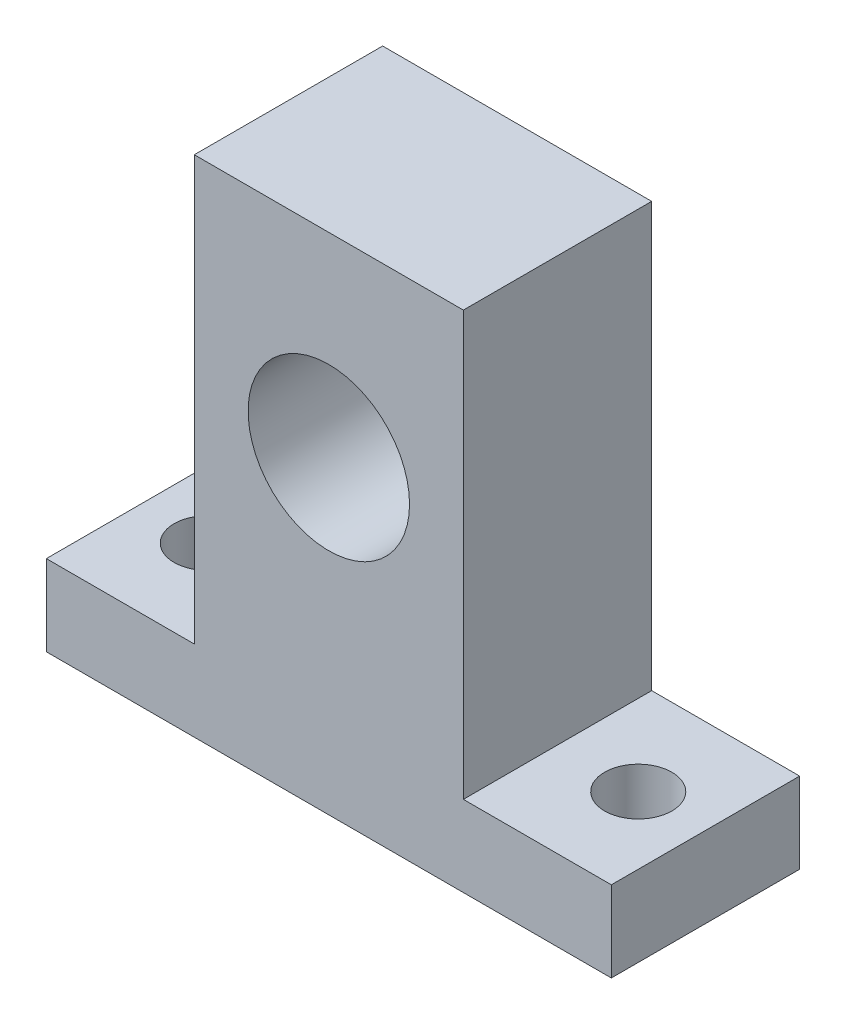
ISO-10303-21;
HEADER;
FILE_DESCRIPTION(('STEP AP214'),'2;1');
FILE_NAME('part.step','',(''),(''),'','','');
FILE_SCHEMA(('AUTOMOTIVE_DESIGN { 1 0 10303 214 1 1 1 1 }'));
ENDSEC;
DATA;
#1=APPLICATION_CONTEXT('core data for automotive mechanical design processes');
#2=APPLICATION_PROTOCOL_DEFINITION('international standard','automotive_design',2000,#1);
#3=PRODUCT_CONTEXT('',#1,'mechanical');
#4=PRODUCT('Part','Part','',(#3));
#5=PRODUCT_RELATED_PRODUCT_CATEGORY('part','',(#4));
#6=PRODUCT_DEFINITION_FORMATION('','',#4);
#7=PRODUCT_DEFINITION_CONTEXT('part definition',#1,'design');
#8=PRODUCT_DEFINITION('design','',#6,#7);
#9=PRODUCT_DEFINITION_SHAPE('','',#8);
#10=(LENGTH_UNIT() NAMED_UNIT(*) SI_UNIT(.MILLI.,.METRE.));
#11=(NAMED_UNIT(*) PLANE_ANGLE_UNIT() SI_UNIT($,.RADIAN.));
#12=(NAMED_UNIT(*) SI_UNIT($,.STERADIAN.) SOLID_ANGLE_UNIT());
#13=UNCERTAINTY_MEASURE_WITH_UNIT(LENGTH_MEASURE(1.E-05),#10,'distance_accuracy_value','');
#14=(GEOMETRIC_REPRESENTATION_CONTEXT(3) GLOBAL_UNCERTAINTY_ASSIGNED_CONTEXT((#13)) GLOBAL_UNIT_ASSIGNED_CONTEXT((#10,
#11,#12)) REPRESENTATION_CONTEXT('',''));
#15=CARTESIAN_POINT('',(0.,0.,0.));
#16=DIRECTION('',(0.,0.,1.));
#17=DIRECTION('',(1.,0.,0.));
#18=AXIS2_PLACEMENT_3D('',#15,#16,#17);
#19=CARTESIAN_POINT('',(42.,0.,-14.));
#20=DIRECTION('',(0.,-1.,0.));
#21=DIRECTION('',(0.,0.,-1.));
#22=AXIS2_PLACEMENT_3D('',#19,#20,#21);
#23=PLANE('',#22);
#24=CARTESIAN_POINT('',(5.,0.,-7.));
#25=DIRECTION('',(0.,-1.,0.));
#26=DIRECTION('',(0.,0.,-1.));
#27=AXIS2_PLACEMENT_3D('',#24,#25,#26);
#28=CIRCLE('',#27,2.5);
#29=CARTESIAN_POINT('',(5.,0.,-9.5));
#30=VERTEX_POINT('',#29);
#31=EDGE_CURVE('E140',#30,#30,#28,.T.);
#32=ORIENTED_EDGE('',*,*,#31,.F.);
#33=EDGE_LOOP('',(#32));
#34=FACE_BOUND('',#33,.T.);
#35=CARTESIAN_POINT('',(37.,0.,-7.));
#36=DIRECTION('',(0.,-1.,0.));
#37=DIRECTION('',(0.,0.,1.));
#38=AXIS2_PLACEMENT_3D('',#35,#36,#37);
#39=CIRCLE('',#38,2.5);
#40=CARTESIAN_POINT('',(37.,0.,-4.49999999999999));
#41=VERTEX_POINT('',#40);
#42=EDGE_CURVE('E225',#41,#41,#39,.T.);
#43=ORIENTED_EDGE('',*,*,#42,.F.);
#44=EDGE_LOOP('',(#43));
#45=FACE_BOUND('',#44,.T.);
#46=DIRECTION('',(1.,0.,0.));
#47=VECTOR('',#46,1.);
#48=CARTESIAN_POINT('',(42.,0.,0.));
#49=LINE('',#48,#47);
#50=CARTESIAN_POINT('',(0.,0.,0.));
#51=VERTEX_POINT('',#50);
#52=CARTESIAN_POINT('',(42.,0.,0.));
#53=VERTEX_POINT('',#52);
#54=EDGE_CURVE('E136',#51,#53,#49,.T.);
#55=ORIENTED_EDGE('',*,*,#54,.F.);
#56=DIRECTION('',(0.,0.,1.));
#57=VECTOR('',#56,1.);
#58=CARTESIAN_POINT('',(0.,0.,-14.));
#59=LINE('',#58,#57);
#60=CARTESIAN_POINT('',(0.,0.,-14.));
#61=VERTEX_POINT('',#60);
#62=EDGE_CURVE('E11',#61,#51,#59,.T.);
#63=ORIENTED_EDGE('',*,*,#62,.F.);
#64=DIRECTION('',(1.,0.,0.));
#65=VECTOR('',#64,1.);
#66=CARTESIAN_POINT('',(42.,0.,-14.));
#67=LINE('',#66,#65);
#68=CARTESIAN_POINT('',(42.,0.,-14.));
#69=VERTEX_POINT('',#68);
#70=EDGE_CURVE('E157',#61,#69,#67,.T.);
#71=ORIENTED_EDGE('',*,*,#70,.T.);
#72=DIRECTION('',(0.,0.,1.));
#73=VECTOR('',#72,1.);
#74=CARTESIAN_POINT('',(42.,0.,-14.));
#75=LINE('',#74,#73);
#76=EDGE_CURVE('E42',#69,#53,#75,.T.);
#77=ORIENTED_EDGE('',*,*,#76,.T.);
#78=EDGE_LOOP('',(#55,#63,#71,#77));
#79=FACE_BOUND('',#78,.T.);
#80=ADVANCED_FACE('F39',(#34,#45,#79),#23,.T.);
#81=CARTESIAN_POINT('',(0.,0.,-14.));
#82=DIRECTION('',(-1.,0.,0.));
#83=DIRECTION('',(0.,0.,1.));
#84=AXIS2_PLACEMENT_3D('',#81,#82,#83);
#85=PLANE('',#84);
#86=DIRECTION('',(0.,-1.,0.));
#87=VECTOR('',#86,1.);
#88=CARTESIAN_POINT('',(0.,0.,0.));
#89=LINE('',#88,#87);
#90=CARTESIAN_POINT('',(0.,6.,0.));
#91=VERTEX_POINT('',#90);
#92=EDGE_CURVE('E155',#91,#51,#89,.T.);
#93=ORIENTED_EDGE('',*,*,#92,.F.);
#94=DIRECTION('',(0.,0.,1.));
#95=VECTOR('',#94,1.);
#96=CARTESIAN_POINT('',(0.,6.,-14.));
#97=LINE('',#96,#95);
#98=CARTESIAN_POINT('',(0.,6.,-14.));
#99=VERTEX_POINT('',#98);
#100=EDGE_CURVE('E48',#99,#91,#97,.T.);
#101=ORIENTED_EDGE('',*,*,#100,.F.);
#102=DIRECTION('',(0.,-1.,0.));
#103=VECTOR('',#102,1.);
#104=CARTESIAN_POINT('',(0.,0.,-14.));
#105=LINE('',#104,#103);
#106=EDGE_CURVE('E126',#99,#61,#105,.T.);
#107=ORIENTED_EDGE('',*,*,#106,.T.);
#108=ORIENTED_EDGE('',*,*,#62,.T.);
#109=EDGE_LOOP('',(#93,#101,#107,#108));
#110=FACE_BOUND('',#109,.T.);
#111=ADVANCED_FACE('F169',(#110),#85,.T.);
#112=CARTESIAN_POINT('',(0.,6.,-14.));
#113=DIRECTION('',(0.,1.,0.));
#114=DIRECTION('',(0.,0.,1.));
#115=AXIS2_PLACEMENT_3D('',#112,#113,#114);
#116=PLANE('',#115);
#117=CARTESIAN_POINT('',(5.,6.,-7.));
#118=DIRECTION('',(0.,1.,0.));
#119=DIRECTION('',(0.,0.,1.));
#120=AXIS2_PLACEMENT_3D('',#117,#118,#119);
#121=CIRCLE('',#120,2.5);
#122=CARTESIAN_POINT('',(5.,6.,-4.5));
#123=VERTEX_POINT('',#122);
#124=EDGE_CURVE('E234',#123,#123,#121,.F.);
#125=ORIENTED_EDGE('',*,*,#124,.T.);
#126=EDGE_LOOP('',(#125));
#127=FACE_BOUND('',#126,.T.);
#128=DIRECTION('',(-1.,0.,0.));
#129=VECTOR('',#128,1.);
#130=CARTESIAN_POINT('',(0.,6.,0.));
#131=LINE('',#130,#129);
#132=CARTESIAN_POINT('',(11.,6.,0.));
#133=VERTEX_POINT('',#132);
#134=EDGE_CURVE('E113',#133,#91,#131,.T.);
#135=ORIENTED_EDGE('',*,*,#134,.F.);
#136=DIRECTION('',(0.,0.,1.));
#137=VECTOR('',#136,1.);
#138=CARTESIAN_POINT('',(11.,6.,-14.));
#139=LINE('',#138,#137);
#140=CARTESIAN_POINT('',(11.,6.,-14.));
#141=VERTEX_POINT('',#140);
#142=EDGE_CURVE('E108',#141,#133,#139,.T.);
#143=ORIENTED_EDGE('',*,*,#142,.F.);
#144=DIRECTION('',(-1.,0.,0.));
#145=VECTOR('',#144,1.);
#146=CARTESIAN_POINT('',(0.,6.,-14.));
#147=LINE('',#146,#145);
#148=EDGE_CURVE('E111',#141,#99,#147,.T.);
#149=ORIENTED_EDGE('',*,*,#148,.T.);
#150=ORIENTED_EDGE('',*,*,#100,.T.);
#151=EDGE_LOOP('',(#135,#143,#149,#150));
#152=FACE_BOUND('',#151,.T.);
#153=ADVANCED_FACE('F110',(#127,#152),#116,.T.);
#154=CARTESIAN_POINT('',(11.,6.,-14.));
#155=DIRECTION('',(-1.,0.,0.));
#156=DIRECTION('',(0.,0.,1.));
#157=AXIS2_PLACEMENT_3D('',#154,#155,#156);
#158=PLANE('',#157);
#159=DIRECTION('',(0.,-1.,0.));
#160=VECTOR('',#159,1.);
#161=CARTESIAN_POINT('',(11.,6.,0.));
#162=LINE('',#161,#160);
#163=CARTESIAN_POINT('',(11.,37.5,0.));
#164=VERTEX_POINT('',#163);
#165=EDGE_CURVE('E152',#164,#133,#162,.T.);
#166=ORIENTED_EDGE('',*,*,#165,.F.);
#167=DIRECTION('',(0.,0.,1.));
#168=VECTOR('',#167,1.);
#169=CARTESIAN_POINT('',(11.,37.5,-14.));
#170=LINE('',#169,#168);
#171=CARTESIAN_POINT('',(11.,37.5,-14.));
#172=VERTEX_POINT('',#171);
#173=EDGE_CURVE('E118',#172,#164,#170,.T.);
#174=ORIENTED_EDGE('',*,*,#173,.F.);
#175=DIRECTION('',(0.,-1.,0.));
#176=VECTOR('',#175,1.);
#177=CARTESIAN_POINT('',(11.,6.,-14.));
#178=LINE('',#177,#176);
#179=EDGE_CURVE('E124',#172,#141,#178,.T.);
#180=ORIENTED_EDGE('',*,*,#179,.T.);
#181=ORIENTED_EDGE('',*,*,#142,.T.);
#182=EDGE_LOOP('',(#166,#174,#180,#181));
#183=FACE_BOUND('',#182,.T.);
#184=ADVANCED_FACE('F128',(#183),#158,.T.);
#185=CARTESIAN_POINT('',(11.,37.5,-14.));
#186=DIRECTION('',(0.,1.,0.));
#187=DIRECTION('',(0.,0.,1.));
#188=AXIS2_PLACEMENT_3D('',#185,#186,#187);
#189=PLANE('',#188);
#190=DIRECTION('',(-1.,0.,0.));
#191=VECTOR('',#190,1.);
#192=CARTESIAN_POINT('',(11.,37.5,0.));
#193=LINE('',#192,#191);
#194=CARTESIAN_POINT('',(31.,37.5,0.));
#195=VERTEX_POINT('',#194);
#196=EDGE_CURVE('E149',#195,#164,#193,.T.);
#197=ORIENTED_EDGE('',*,*,#196,.F.);
#198=DIRECTION('',(0.,0.,1.));
#199=VECTOR('',#198,1.);
#200=CARTESIAN_POINT('',(31.,37.5,-14.));
#201=LINE('',#200,#199);
#202=CARTESIAN_POINT('',(31.,37.5,-14.));
#203=VERTEX_POINT('',#202);
#204=EDGE_CURVE('E161',#203,#195,#201,.T.);
#205=ORIENTED_EDGE('',*,*,#204,.F.);
#206=DIRECTION('',(-1.,0.,0.));
#207=VECTOR('',#206,1.);
#208=CARTESIAN_POINT('',(11.,37.5,-14.));
#209=LINE('',#208,#207);
#210=EDGE_CURVE('E129',#203,#172,#209,.T.);
#211=ORIENTED_EDGE('',*,*,#210,.T.);
#212=ORIENTED_EDGE('',*,*,#173,.T.);
#213=EDGE_LOOP('',(#197,#205,#211,#212));
#214=FACE_BOUND('',#213,.T.);
#215=ADVANCED_FACE('F184',(#214),#189,.T.);
#216=CARTESIAN_POINT('',(31.,37.5,-14.));
#217=DIRECTION('',(1.,0.,0.));
#218=DIRECTION('',(0.,1.,0.));
#219=AXIS2_PLACEMENT_3D('',#216,#217,#218);
#220=PLANE('',#219);
#221=DIRECTION('',(0.,1.,0.));
#222=VECTOR('',#221,1.);
#223=CARTESIAN_POINT('',(31.,37.5,0.));
#224=LINE('',#223,#222);
#225=CARTESIAN_POINT('',(31.,6.,0.));
#226=VERTEX_POINT('',#225);
#227=EDGE_CURVE('E146',#226,#195,#224,.T.);
#228=ORIENTED_EDGE('',*,*,#227,.F.);
#229=DIRECTION('',(0.,0.,1.));
#230=VECTOR('',#229,1.);
#231=CARTESIAN_POINT('',(31.,6.,-14.));
#232=LINE('',#231,#230);
#233=CARTESIAN_POINT('',(31.,6.,-14.));
#234=VERTEX_POINT('',#233);
#235=EDGE_CURVE('E163',#234,#226,#232,.T.);
#236=ORIENTED_EDGE('',*,*,#235,.F.);
#237=DIRECTION('',(0.,1.,0.));
#238=VECTOR('',#237,1.);
#239=CARTESIAN_POINT('',(31.,37.5,-14.));
#240=LINE('',#239,#238);
#241=EDGE_CURVE('E131',#234,#203,#240,.T.);
#242=ORIENTED_EDGE('',*,*,#241,.T.);
#243=ORIENTED_EDGE('',*,*,#204,.T.);
#244=EDGE_LOOP('',(#228,#236,#242,#243));
#245=FACE_BOUND('',#244,.T.);
#246=ADVANCED_FACE('F187',(#245),#220,.T.);
#247=CARTESIAN_POINT('',(31.,6.,-14.));
#248=DIRECTION('',(0.,1.,0.));
#249=DIRECTION('',(0.,0.,1.));
#250=AXIS2_PLACEMENT_3D('',#247,#248,#249);
#251=PLANE('',#250);
#252=CARTESIAN_POINT('',(37.,6.,-7.));
#253=DIRECTION('',(0.,1.,0.));
#254=DIRECTION('',(0.,0.,1.));
#255=AXIS2_PLACEMENT_3D('',#252,#253,#254);
#256=CIRCLE('',#255,2.5);
#257=CARTESIAN_POINT('',(37.,6.,-4.49999999999999));
#258=VERTEX_POINT('',#257);
#259=EDGE_CURVE('E228',#258,#258,#256,.F.);
#260=ORIENTED_EDGE('',*,*,#259,.T.);
#261=EDGE_LOOP('',(#260));
#262=FACE_BOUND('',#261,.T.);
#263=DIRECTION('',(-1.,0.,0.));
#264=VECTOR('',#263,1.);
#265=CARTESIAN_POINT('',(31.,6.,0.));
#266=LINE('',#265,#264);
#267=CARTESIAN_POINT('',(42.,6.,0.));
#268=VERTEX_POINT('',#267);
#269=EDGE_CURVE('E143',#268,#226,#266,.T.);
#270=ORIENTED_EDGE('',*,*,#269,.F.);
#271=DIRECTION('',(0.,0.,1.));
#272=VECTOR('',#271,1.);
#273=CARTESIAN_POINT('',(42.,6.,-14.));
#274=LINE('',#273,#272);
#275=CARTESIAN_POINT('',(42.,6.,-14.));
#276=VERTEX_POINT('',#275);
#277=EDGE_CURVE('E164',#276,#268,#274,.T.);
#278=ORIENTED_EDGE('',*,*,#277,.F.);
#279=DIRECTION('',(-1.,0.,0.));
#280=VECTOR('',#279,1.);
#281=CARTESIAN_POINT('',(31.,6.,-14.));
#282=LINE('',#281,#280);
#283=EDGE_CURVE('E242',#276,#234,#282,.T.);
#284=ORIENTED_EDGE('',*,*,#283,.T.);
#285=ORIENTED_EDGE('',*,*,#235,.T.);
#286=EDGE_LOOP('',(#270,#278,#284,#285));
#287=FACE_BOUND('',#286,.T.);
#288=ADVANCED_FACE('F191',(#262,#287),#251,.T.);
#289=CARTESIAN_POINT('',(42.,6.,-14.));
#290=DIRECTION('',(1.,0.,0.));
#291=DIRECTION('',(0.,0.,-1.));
#292=AXIS2_PLACEMENT_3D('',#289,#290,#291);
#293=PLANE('',#292);
#294=DIRECTION('',(0.,1.,0.));
#295=VECTOR('',#294,1.);
#296=CARTESIAN_POINT('',(42.,6.,0.));
#297=LINE('',#296,#295);
#298=EDGE_CURVE('E139',#53,#268,#297,.T.);
#299=ORIENTED_EDGE('',*,*,#298,.F.);
#300=ORIENTED_EDGE('',*,*,#76,.F.);
#301=DIRECTION('',(0.,1.,0.));
#302=VECTOR('',#301,1.);
#303=CARTESIAN_POINT('',(42.,6.,-14.));
#304=LINE('',#303,#302);
#305=EDGE_CURVE('E240',#69,#276,#304,.T.);
#306=ORIENTED_EDGE('',*,*,#305,.T.);
#307=ORIENTED_EDGE('',*,*,#277,.T.);
#308=EDGE_LOOP('',(#299,#300,#306,#307));
#309=FACE_BOUND('',#308,.T.);
#310=ADVANCED_FACE('F166',(#309),#293,.T.);
#311=CARTESIAN_POINT('',(0.,0.,-14.));
#312=DIRECTION('',(0.,0.,-1.));
#313=DIRECTION('',(-1.,0.,0.));
#314=AXIS2_PLACEMENT_3D('',#311,#312,#313);
#315=PLANE('',#314);
#316=CARTESIAN_POINT('',(21.,23.,-14.));
#317=DIRECTION('',(0.,0.,-1.));
#318=DIRECTION('',(-1.,0.,0.));
#319=AXIS2_PLACEMENT_3D('',#316,#317,#318);
#320=CIRCLE('',#319,6.);
#321=CARTESIAN_POINT('',(15.,23.,-14.));
#322=VERTEX_POINT('',#321);
#323=EDGE_CURVE('E221',#322,#322,#320,.F.);
#324=ORIENTED_EDGE('',*,*,#323,.T.);
#325=EDGE_LOOP('',(#324));
#326=FACE_BOUND('',#325,.T.);
#327=ORIENTED_EDGE('',*,*,#70,.F.);
#328=ORIENTED_EDGE('',*,*,#106,.F.);
#329=ORIENTED_EDGE('',*,*,#148,.F.);
#330=ORIENTED_EDGE('',*,*,#179,.F.);
#331=ORIENTED_EDGE('',*,*,#210,.F.);
#332=ORIENTED_EDGE('',*,*,#241,.F.);
#333=ORIENTED_EDGE('',*,*,#283,.F.);
#334=ORIENTED_EDGE('',*,*,#305,.F.);
#335=EDGE_LOOP('',(#327,#328,#329,#330,#331,#332,#333,#334));
#336=FACE_BOUND('',#335,.T.);
#337=ADVANCED_FACE('F122',(#326,#336),#315,.T.);
#338=CARTESIAN_POINT('',(0.,0.,0.));
#339=DIRECTION('',(0.,0.,-1.));
#340=DIRECTION('',(-1.,0.,0.));
#341=AXIS2_PLACEMENT_3D('',#338,#339,#340);
#342=PLANE('',#341);
#343=CARTESIAN_POINT('',(21.,23.,0.));
#344=DIRECTION('',(0.,0.,1.));
#345=DIRECTION('',(1.,0.,0.));
#346=AXIS2_PLACEMENT_3D('',#343,#344,#345);
#347=CIRCLE('',#346,6.);
#348=CARTESIAN_POINT('',(27.,23.,0.));
#349=VERTEX_POINT('',#348);
#350=EDGE_CURVE('E224',#349,#349,#347,.T.);
#351=ORIENTED_EDGE('',*,*,#350,.F.);
#352=EDGE_LOOP('',(#351));
#353=FACE_BOUND('',#352,.T.);
#354=ORIENTED_EDGE('',*,*,#54,.T.);
#355=ORIENTED_EDGE('',*,*,#298,.T.);
#356=ORIENTED_EDGE('',*,*,#269,.T.);
#357=ORIENTED_EDGE('',*,*,#227,.T.);
#358=ORIENTED_EDGE('',*,*,#196,.T.);
#359=ORIENTED_EDGE('',*,*,#165,.T.);
#360=ORIENTED_EDGE('',*,*,#134,.T.);
#361=ORIENTED_EDGE('',*,*,#92,.T.);
#362=EDGE_LOOP('',(#354,#355,#356,#357,#358,#359,#360,#361));
#363=FACE_BOUND('',#362,.T.);
#364=ADVANCED_FACE('F168',(#353,#363),#342,.F.);
#365=CARTESIAN_POINT('',(37.,37.501,-7.));
#366=DIRECTION('',(0.,-1.,0.));
#367=DIRECTION('',(0.,0.,-1.));
#368=AXIS2_PLACEMENT_3D('',#365,#366,#367);
#369=CYLINDRICAL_SURFACE('',#368,2.5);
#370=ORIENTED_EDGE('',*,*,#259,.F.);
#371=EDGE_LOOP('',(#370));
#372=FACE_BOUND('',#371,.T.);
#373=ORIENTED_EDGE('',*,*,#42,.T.);
#374=EDGE_LOOP('',(#373));
#375=FACE_BOUND('',#374,.T.);
#376=ADVANCED_FACE('F204',(#372,#375),#369,.F.);
#377=CARTESIAN_POINT('',(5.,37.501,-7.));
#378=DIRECTION('',(0.,-1.,0.));
#379=DIRECTION('',(0.,0.,-1.));
#380=AXIS2_PLACEMENT_3D('',#377,#378,#379);
#381=CYLINDRICAL_SURFACE('',#380,2.5);
#382=ORIENTED_EDGE('',*,*,#124,.F.);
#383=EDGE_LOOP('',(#382));
#384=FACE_BOUND('',#383,.T.);
#385=ORIENTED_EDGE('',*,*,#31,.T.);
#386=EDGE_LOOP('',(#385));
#387=FACE_BOUND('',#386,.T.);
#388=ADVANCED_FACE('F210',(#384,#387),#381,.F.);
#389=CARTESIAN_POINT('',(21.,23.,-14.001));
#390=DIRECTION('',(0.,0.,1.));
#391=DIRECTION('',(1.,0.,0.));
#392=AXIS2_PLACEMENT_3D('',#389,#390,#391);
#393=CYLINDRICAL_SURFACE('',#392,6.);
#394=ORIENTED_EDGE('',*,*,#323,.F.);
#395=EDGE_LOOP('',(#394));
#396=FACE_BOUND('',#395,.T.);
#397=ORIENTED_EDGE('',*,*,#350,.T.);
#398=EDGE_LOOP('',(#397));
#399=FACE_BOUND('',#398,.T.);
#400=ADVANCED_FACE('F213',(#396,#399),#393,.F.);
#401=CLOSED_SHELL('',(#80,#111,#153,#184,#215,#246,#288,#310,#337,#364,#376,#388,#400));
#402=MANIFOLD_SOLID_BREP('B2',#401);
#403=ADVANCED_BREP_SHAPE_REPRESENTATION('',(#18,#402),#14);
#404=SHAPE_DEFINITION_REPRESENTATION(#9,#403);
ENDSEC;
END-ISO-10303-21;
